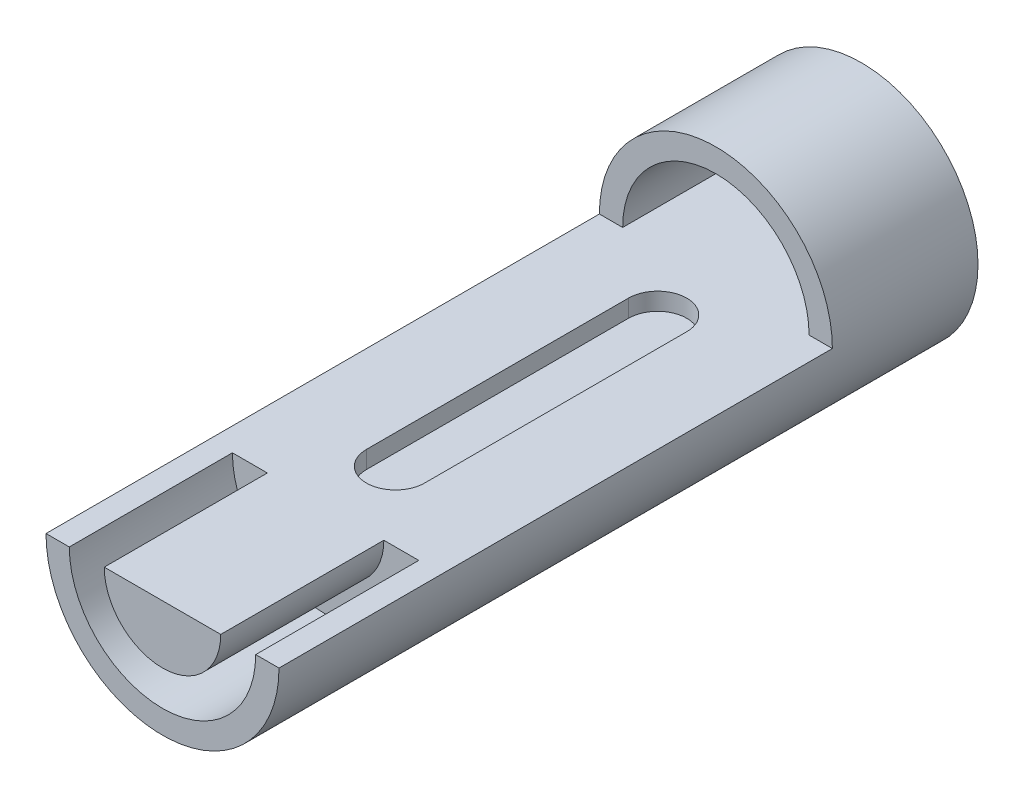
ISO-10303-21;
HEADER;
FILE_DESCRIPTION(('STEP AP214'),'2;1');
FILE_NAME('part.step','',(''),(''),'','','');
FILE_SCHEMA(('AUTOMOTIVE_DESIGN { 1 0 10303 214 1 1 1 1 }'));
ENDSEC;
DATA;
#1=APPLICATION_CONTEXT('core data for automotive mechanical design processes');
#2=APPLICATION_PROTOCOL_DEFINITION('international standard','automotive_design',2000,#1);
#3=PRODUCT_CONTEXT('',#1,'mechanical');
#4=PRODUCT('Part','Part','',(#3));
#5=PRODUCT_RELATED_PRODUCT_CATEGORY('part','',(#4));
#6=PRODUCT_DEFINITION_FORMATION('','',#4);
#7=PRODUCT_DEFINITION_CONTEXT('part definition',#1,'design');
#8=PRODUCT_DEFINITION('design','',#6,#7);
#9=PRODUCT_DEFINITION_SHAPE('','',#8);
#10=(LENGTH_UNIT() NAMED_UNIT(*) SI_UNIT(.MILLI.,.METRE.));
#11=(NAMED_UNIT(*) PLANE_ANGLE_UNIT() SI_UNIT($,.RADIAN.));
#12=(NAMED_UNIT(*) SI_UNIT($,.STERADIAN.) SOLID_ANGLE_UNIT());
#13=UNCERTAINTY_MEASURE_WITH_UNIT(LENGTH_MEASURE(1.E-05),#10,'distance_accuracy_value','');
#14=(GEOMETRIC_REPRESENTATION_CONTEXT(3) GLOBAL_UNCERTAINTY_ASSIGNED_CONTEXT((#13)) GLOBAL_UNIT_ASSIGNED_CONTEXT((#10,
#11,#12)) REPRESENTATION_CONTEXT('',''));
#15=CARTESIAN_POINT('',(0.,0.,0.));
#16=DIRECTION('',(0.,0.,1.));
#17=DIRECTION('',(1.,0.,0.));
#18=AXIS2_PLACEMENT_3D('',#15,#16,#17);
#19=CARTESIAN_POINT('',(0.,0.,120.));
#20=DIRECTION('',(0.,0.,1.));
#21=DIRECTION('',(1.,0.,0.));
#22=AXIS2_PLACEMENT_3D('',#19,#20,#21);
#23=PLANE('',#22);
#24=DIRECTION('',(1.,0.,0.));
#25=VECTOR('',#24,1.);
#26=CARTESIAN_POINT('',(-20.,0.,120.));
#27=LINE('',#26,#25);
#28=CARTESIAN_POINT('',(-10.,0.,120.));
#29=VERTEX_POINT('',#28);
#30=CARTESIAN_POINT('',(10.,0.,120.));
#31=VERTEX_POINT('',#30);
#32=EDGE_CURVE('E246',#29,#31,#27,.T.);
#33=ORIENTED_EDGE('',*,*,#32,.F.);
#34=CARTESIAN_POINT('',(0.,0.,120.));
#35=DIRECTION('',(0.,0.,1.));
#36=DIRECTION('',(1.,0.,0.));
#37=AXIS2_PLACEMENT_3D('',#34,#35,#36);
#38=CIRCLE('',#37,10.);
#39=EDGE_CURVE('E178',#29,#31,#38,.T.);
#40=ORIENTED_EDGE('',*,*,#39,.T.);
#41=EDGE_LOOP('',(#33,#40));
#42=FACE_BOUND('',#41,.T.);
#43=ADVANCED_FACE('F41',(#42),#23,.T.);
#44=CARTESIAN_POINT('',(-20.,0.,25.));
#45=DIRECTION('',(0.,-1.,0.));
#46=DIRECTION('',(0.,0.,-1.));
#47=AXIS2_PLACEMENT_3D('',#44,#45,#46);
#48=PLANE('',#47);
#49=CARTESIAN_POINT('',(0.,0.,80.));
#50=DIRECTION('',(0.,1.,0.));
#51=DIRECTION('',(0.,0.,1.));
#52=AXIS2_PLACEMENT_3D('',#49,#50,#51);
#53=CIRCLE('',#52,5.);
#54=CARTESIAN_POINT('',(-5.00000000000002,0.,80.));
#55=VERTEX_POINT('',#54);
#56=CARTESIAN_POINT('',(4.99999999999998,0.,80.));
#57=VERTEX_POINT('',#56);
#58=EDGE_CURVE('E170',#55,#57,#53,.T.);
#59=ORIENTED_EDGE('',*,*,#58,.F.);
#60=DIRECTION('',(0.,0.,1.));
#61=VECTOR('',#60,1.);
#62=CARTESIAN_POINT('',(-5.00000000000001,0.,0.));
#63=LINE('',#62,#61);
#64=CARTESIAN_POINT('',(-5.00000000000001,0.,35.));
#65=VERTEX_POINT('',#64);
#66=EDGE_CURVE('E57',#65,#55,#63,.T.);
#67=ORIENTED_EDGE('',*,*,#66,.F.);
#68=CARTESIAN_POINT('',(0.,0.,35.));
#69=DIRECTION('',(0.,1.,0.));
#70=DIRECTION('',(0.,0.,1.));
#71=AXIS2_PLACEMENT_3D('',#68,#69,#70);
#72=CIRCLE('',#71,5.);
#73=CARTESIAN_POINT('',(4.99999999999999,0.,35.));
#74=VERTEX_POINT('',#73);
#75=EDGE_CURVE('E155',#74,#65,#72,.T.);
#76=ORIENTED_EDGE('',*,*,#75,.F.);
#77=DIRECTION('',(0.,0.,1.));
#78=VECTOR('',#77,1.);
#79=CARTESIAN_POINT('',(4.99999999999999,0.,0.));
#80=LINE('',#79,#78);
#81=EDGE_CURVE('E161',#74,#57,#80,.T.);
#82=ORIENTED_EDGE('',*,*,#81,.T.);
#83=EDGE_LOOP('',(#59,#67,#76,#82));
#84=FACE_BOUND('',#83,.T.);
#85=DIRECTION('',(0.,0.,1.));
#86=VECTOR('',#85,1.);
#87=CARTESIAN_POINT('',(10.,0.,92.));
#88=LINE('',#87,#86);
#89=CARTESIAN_POINT('',(10.,0.,92.));
#90=VERTEX_POINT('',#89);
#91=EDGE_CURVE('E200',#90,#31,#88,.T.);
#92=ORIENTED_EDGE('',*,*,#91,.F.);
#93=DIRECTION('',(-1.,0.,0.));
#94=VECTOR('',#93,1.);
#95=CARTESIAN_POINT('',(0.,0.,92.));
#96=LINE('',#95,#94);
#97=CARTESIAN_POINT('',(16.,0.,92.));
#98=VERTEX_POINT('',#97);
#99=EDGE_CURVE('E191',#98,#90,#96,.T.);
#100=ORIENTED_EDGE('',*,*,#99,.F.);
#101=DIRECTION('',(0.,0.,1.));
#102=VECTOR('',#101,1.);
#103=CARTESIAN_POINT('',(16.,0.,92.));
#104=LINE('',#103,#102);
#105=CARTESIAN_POINT('',(16.,0.,120.));
#106=VERTEX_POINT('',#105);
#107=EDGE_CURVE('E204',#98,#106,#104,.T.);
#108=ORIENTED_EDGE('',*,*,#107,.T.);
#109=CARTESIAN_POINT('',(20.,0.,120.));
#110=VERTEX_POINT('',#109);
#111=EDGE_CURVE('E230',#106,#110,#27,.T.);
#112=ORIENTED_EDGE('',*,*,#111,.T.);
#113=DIRECTION('',(0.,0.,1.));
#114=VECTOR('',#113,1.);
#115=CARTESIAN_POINT('',(20.,0.,25.));
#116=LINE('',#115,#114);
#117=CARTESIAN_POINT('',(20.,0.,25.));
#118=VERTEX_POINT('',#117);
#119=EDGE_CURVE('E247',#118,#110,#116,.T.);
#120=ORIENTED_EDGE('',*,*,#119,.F.);
#121=DIRECTION('',(1.,0.,0.));
#122=VECTOR('',#121,1.);
#123=CARTESIAN_POINT('',(-20.,0.,25.));
#124=LINE('',#123,#122);
#125=CARTESIAN_POINT('',(16.,0.,25.));
#126=VERTEX_POINT('',#125);
#127=EDGE_CURVE('E236',#126,#118,#124,.T.);
#128=ORIENTED_EDGE('',*,*,#127,.F.);
#129=DIRECTION('',(0.,0.,1.));
#130=VECTOR('',#129,1.);
#131=CARTESIAN_POINT('',(16.,0.,0.));
#132=LINE('',#131,#130);
#133=CARTESIAN_POINT('',(16.,0.,0.));
#134=VERTEX_POINT('',#133);
#135=EDGE_CURVE('E223',#134,#126,#132,.T.);
#136=ORIENTED_EDGE('',*,*,#135,.F.);
#137=DIRECTION('',(1.,0.,0.));
#138=VECTOR('',#137,1.);
#139=CARTESIAN_POINT('',(0.,0.,0.));
#140=LINE('',#139,#138);
#141=CARTESIAN_POINT('',(-16.,0.,0.));
#142=VERTEX_POINT('',#141);
#143=EDGE_CURVE('E215',#142,#134,#140,.T.);
#144=ORIENTED_EDGE('',*,*,#143,.F.);
#145=DIRECTION('',(0.,0.,1.));
#146=VECTOR('',#145,1.);
#147=CARTESIAN_POINT('',(-16.,0.,0.));
#148=LINE('',#147,#146);
#149=CARTESIAN_POINT('',(-16.,0.,25.));
#150=VERTEX_POINT('',#149);
#151=EDGE_CURVE('E227',#142,#150,#148,.T.);
#152=ORIENTED_EDGE('',*,*,#151,.T.);
#153=CARTESIAN_POINT('',(-20.,0.,25.));
#154=VERTEX_POINT('',#153);
#155=EDGE_CURVE('E238',#154,#150,#124,.T.);
#156=ORIENTED_EDGE('',*,*,#155,.F.);
#157=DIRECTION('',(0.,0.,1.));
#158=VECTOR('',#157,1.);
#159=CARTESIAN_POINT('',(-20.,0.,25.));
#160=LINE('',#159,#158);
#161=CARTESIAN_POINT('',(-20.,0.,120.));
#162=VERTEX_POINT('',#161);
#163=EDGE_CURVE('E242',#154,#162,#160,.T.);
#164=ORIENTED_EDGE('',*,*,#163,.T.);
#165=CARTESIAN_POINT('',(-16.,0.,120.));
#166=VERTEX_POINT('',#165);
#167=EDGE_CURVE('E237',#162,#166,#27,.T.);
#168=ORIENTED_EDGE('',*,*,#167,.T.);
#169=DIRECTION('',(0.,0.,1.));
#170=VECTOR('',#169,1.);
#171=CARTESIAN_POINT('',(-16.,0.,92.));
#172=LINE('',#171,#170);
#173=CARTESIAN_POINT('',(-16.,0.,92.));
#174=VERTEX_POINT('',#173);
#175=EDGE_CURVE('E208',#174,#166,#172,.T.);
#176=ORIENTED_EDGE('',*,*,#175,.F.);
#177=CARTESIAN_POINT('',(-10.,0.,92.));
#178=VERTEX_POINT('',#177);
#179=EDGE_CURVE('E186',#178,#174,#96,.T.);
#180=ORIENTED_EDGE('',*,*,#179,.F.);
#181=DIRECTION('',(0.,0.,1.));
#182=VECTOR('',#181,1.);
#183=CARTESIAN_POINT('',(-10.,0.,92.));
#184=LINE('',#183,#182);
#185=EDGE_CURVE('E211',#178,#29,#184,.T.);
#186=ORIENTED_EDGE('',*,*,#185,.T.);
#187=ORIENTED_EDGE('',*,*,#32,.T.);
#188=EDGE_LOOP('',(#92,#100,#108,#112,#120,#128,#136,#144,#152,#156,#164,#168,#176,#180,#186,#187));
#189=FACE_BOUND('',#188,.T.);
#190=ADVANCED_FACE('F258',(#84,#189),#48,.F.);
#191=CARTESIAN_POINT('',(0.,0.,120.));
#192=DIRECTION('',(0.,0.,-1.));
#193=DIRECTION('',(-1.,0.,0.));
#194=AXIS2_PLACEMENT_3D('',#191,#192,#193);
#195=CYLINDRICAL_SURFACE('',#194,20.);
#196=CARTESIAN_POINT('',(0.,0.,120.));
#197=DIRECTION('',(0.,0.,1.));
#198=DIRECTION('',(1.,0.,0.));
#199=AXIS2_PLACEMENT_3D('',#196,#197,#198);
#200=CIRCLE('',#199,20.);
#201=EDGE_CURVE('E11',#162,#110,#200,.T.);
#202=ORIENTED_EDGE('',*,*,#201,.F.);
#203=ORIENTED_EDGE('',*,*,#163,.F.);
#204=CARTESIAN_POINT('',(0.,0.,25.));
#205=DIRECTION('',(0.,0.,1.));
#206=DIRECTION('',(1.,0.,0.));
#207=AXIS2_PLACEMENT_3D('',#204,#205,#206);
#208=CIRCLE('',#207,20.);
#209=EDGE_CURVE('E233',#118,#154,#208,.T.);
#210=ORIENTED_EDGE('',*,*,#209,.F.);
#211=ORIENTED_EDGE('',*,*,#119,.T.);
#212=EDGE_LOOP('',(#202,#203,#210,#211));
#213=FACE_BOUND('',#212,.T.);
#214=CARTESIAN_POINT('',(0.,0.,0.));
#215=DIRECTION('',(0.,0.,1.));
#216=DIRECTION('',(1.,0.,0.));
#217=AXIS2_PLACEMENT_3D('',#214,#215,#216);
#218=CIRCLE('',#217,20.);
#219=CARTESIAN_POINT('',(20.,0.,0.));
#220=VERTEX_POINT('',#219);
#221=EDGE_CURVE('E45',#220,#220,#218,.T.);
#222=ORIENTED_EDGE('',*,*,#221,.T.);
#223=EDGE_LOOP('',(#222));
#224=FACE_BOUND('',#223,.T.);
#225=ADVANCED_FACE('F43',(#213,#224),#195,.T.);
#226=CARTESIAN_POINT('',(0.,0.,120.));
#227=DIRECTION('',(0.,0.,1.));
#228=DIRECTION('',(1.,0.,0.));
#229=AXIS2_PLACEMENT_3D('',#226,#227,#228);
#230=CIRCLE('',#229,16.);
#231=EDGE_CURVE('E187',#166,#106,#230,.T.);
#232=ORIENTED_EDGE('',*,*,#231,.F.);
#233=ORIENTED_EDGE('',*,*,#167,.F.);
#234=ORIENTED_EDGE('',*,*,#201,.T.);
#235=ORIENTED_EDGE('',*,*,#111,.F.);
#236=EDGE_LOOP('',(#232,#233,#234,#235));
#237=FACE_BOUND('',#236,.T.);
#238=ADVANCED_FACE('F265',(#237),#23,.T.);
#239=CARTESIAN_POINT('',(0.,0.,0.));
#240=DIRECTION('',(0.,0.,1.));
#241=DIRECTION('',(1.,0.,0.));
#242=AXIS2_PLACEMENT_3D('',#239,#240,#241);
#243=PLANE('',#242);
#244=CARTESIAN_POINT('',(0.,0.,0.));
#245=DIRECTION('',(0.,0.,1.));
#246=DIRECTION('',(1.,0.,0.));
#247=AXIS2_PLACEMENT_3D('',#244,#245,#246);
#248=CIRCLE('',#247,16.);
#249=EDGE_CURVE('E219',#134,#142,#248,.T.);
#250=ORIENTED_EDGE('',*,*,#249,.T.);
#251=ORIENTED_EDGE('',*,*,#143,.T.);
#252=EDGE_LOOP('',(#250,#251));
#253=FACE_BOUND('',#252,.T.);
#254=ORIENTED_EDGE('',*,*,#221,.F.);
#255=EDGE_LOOP('',(#254));
#256=FACE_BOUND('',#255,.T.);
#257=ADVANCED_FACE('F317',(#253,#256),#243,.F.);
#258=CARTESIAN_POINT('',(0.,0.,25.));
#259=DIRECTION('',(0.,0.,1.));
#260=DIRECTION('',(1.,0.,0.));
#261=AXIS2_PLACEMENT_3D('',#258,#259,#260);
#262=PLANE('',#261);
#263=CARTESIAN_POINT('',(0.,0.,25.));
#264=DIRECTION('',(0.,0.,1.));
#265=DIRECTION('',(1.,0.,0.));
#266=AXIS2_PLACEMENT_3D('',#263,#264,#265);
#267=CIRCLE('',#266,16.);
#268=EDGE_CURVE('E203',#126,#150,#267,.T.);
#269=ORIENTED_EDGE('',*,*,#268,.F.);
#270=ORIENTED_EDGE('',*,*,#127,.T.);
#271=ORIENTED_EDGE('',*,*,#209,.T.);
#272=ORIENTED_EDGE('',*,*,#155,.T.);
#273=EDGE_LOOP('',(#269,#270,#271,#272));
#274=FACE_BOUND('',#273,.T.);
#275=ADVANCED_FACE('F322',(#274),#262,.T.);
#276=CARTESIAN_POINT('',(0.,0.,0.));
#277=DIRECTION('',(0.,0.,1.));
#278=DIRECTION('',(1.,0.,0.));
#279=AXIS2_PLACEMENT_3D('',#276,#277,#278);
#280=CYLINDRICAL_SURFACE('',#279,16.);
#281=ORIENTED_EDGE('',*,*,#268,.T.);
#282=ORIENTED_EDGE('',*,*,#151,.F.);
#283=ORIENTED_EDGE('',*,*,#249,.F.);
#284=ORIENTED_EDGE('',*,*,#135,.T.);
#285=EDGE_LOOP('',(#281,#282,#283,#284));
#286=FACE_BOUND('',#285,.T.);
#287=ADVANCED_FACE('F307',(#286),#280,.F.);
#288=CARTESIAN_POINT('',(0.,0.,92.));
#289=DIRECTION('',(0.,0.,1.));
#290=DIRECTION('',(1.,0.,0.));
#291=AXIS2_PLACEMENT_3D('',#288,#289,#290);
#292=CYLINDRICAL_SURFACE('',#291,10.);
#293=ORIENTED_EDGE('',*,*,#39,.F.);
#294=ORIENTED_EDGE('',*,*,#185,.F.);
#295=CARTESIAN_POINT('',(0.,0.,92.));
#296=DIRECTION('',(0.,0.,1.));
#297=DIRECTION('',(1.,0.,0.));
#298=AXIS2_PLACEMENT_3D('',#295,#296,#297);
#299=CIRCLE('',#298,10.);
#300=EDGE_CURVE('E65',#178,#90,#299,.T.);
#301=ORIENTED_EDGE('',*,*,#300,.T.);
#302=ORIENTED_EDGE('',*,*,#91,.T.);
#303=EDGE_LOOP('',(#293,#294,#301,#302));
#304=FACE_BOUND('',#303,.T.);
#305=ADVANCED_FACE('F280',(#304),#292,.T.);
#306=CARTESIAN_POINT('',(0.,0.,92.));
#307=DIRECTION('',(0.,0.,1.));
#308=DIRECTION('',(1.,0.,0.));
#309=AXIS2_PLACEMENT_3D('',#306,#307,#308);
#310=CYLINDRICAL_SURFACE('',#309,16.);
#311=ORIENTED_EDGE('',*,*,#231,.T.);
#312=ORIENTED_EDGE('',*,*,#107,.F.);
#313=CARTESIAN_POINT('',(0.,0.,92.));
#314=DIRECTION('',(0.,0.,1.));
#315=DIRECTION('',(1.,0.,0.));
#316=AXIS2_PLACEMENT_3D('',#313,#314,#315);
#317=CIRCLE('',#316,16.);
#318=EDGE_CURVE('E190',#174,#98,#317,.T.);
#319=ORIENTED_EDGE('',*,*,#318,.F.);
#320=ORIENTED_EDGE('',*,*,#175,.T.);
#321=EDGE_LOOP('',(#311,#312,#319,#320));
#322=FACE_BOUND('',#321,.T.);
#323=ADVANCED_FACE('F299',(#322),#310,.F.);
#324=CARTESIAN_POINT('',(0.,0.,92.));
#325=DIRECTION('',(0.,0.,1.));
#326=DIRECTION('',(1.,0.,0.));
#327=AXIS2_PLACEMENT_3D('',#324,#325,#326);
#328=PLANE('',#327);
#329=ORIENTED_EDGE('',*,*,#300,.F.);
#330=ORIENTED_EDGE('',*,*,#179,.T.);
#331=ORIENTED_EDGE('',*,*,#318,.T.);
#332=ORIENTED_EDGE('',*,*,#99,.T.);
#333=EDGE_LOOP('',(#329,#330,#331,#332));
#334=FACE_BOUND('',#333,.T.);
#335=ADVANCED_FACE('F281',(#334),#328,.T.);
#336=CARTESIAN_POINT('',(-5.00000000000001,-3.,0.));
#337=DIRECTION('',(-1.,0.,0.));
#338=DIRECTION('',(0.,0.,1.));
#339=AXIS2_PLACEMENT_3D('',#336,#337,#338);
#340=PLANE('',#339);
#341=ORIENTED_EDGE('',*,*,#66,.T.);
#342=DIRECTION('',(0.,1.,0.));
#343=VECTOR('',#342,1.);
#344=CARTESIAN_POINT('',(-5.00000000000002,-3.,80.));
#345=LINE('',#344,#343);
#346=CARTESIAN_POINT('',(-5.00000000000002,-3.,80.));
#347=VERTEX_POINT('',#346);
#348=EDGE_CURVE('E130',#347,#55,#345,.T.);
#349=ORIENTED_EDGE('',*,*,#348,.F.);
#350=DIRECTION('',(0.,0.,1.));
#351=VECTOR('',#350,1.);
#352=CARTESIAN_POINT('',(-5.00000000000001,-3.,0.));
#353=LINE('',#352,#351);
#354=CARTESIAN_POINT('',(-5.00000000000001,-3.,35.));
#355=VERTEX_POINT('',#354);
#356=EDGE_CURVE('E134',#355,#347,#353,.T.);
#357=ORIENTED_EDGE('',*,*,#356,.F.);
#358=DIRECTION('',(0.,1.,0.));
#359=VECTOR('',#358,1.);
#360=CARTESIAN_POINT('',(-5.00000000000001,-3.,35.));
#361=LINE('',#360,#359);
#362=EDGE_CURVE('E176',#355,#65,#361,.T.);
#363=ORIENTED_EDGE('',*,*,#362,.T.);
#364=EDGE_LOOP('',(#341,#349,#357,#363));
#365=FACE_BOUND('',#364,.T.);
#366=ADVANCED_FACE('F132',(#365),#340,.F.);
#367=CARTESIAN_POINT('',(0.,-3.,35.));
#368=DIRECTION('',(0.,1.,0.));
#369=DIRECTION('',(0.,0.,1.));
#370=AXIS2_PLACEMENT_3D('',#367,#368,#369);
#371=CYLINDRICAL_SURFACE('',#370,5.);
#372=ORIENTED_EDGE('',*,*,#75,.T.);
#373=ORIENTED_EDGE('',*,*,#362,.F.);
#374=CARTESIAN_POINT('',(0.,-3.,35.));
#375=DIRECTION('',(0.,1.,0.));
#376=DIRECTION('',(0.,0.,1.));
#377=AXIS2_PLACEMENT_3D('',#374,#375,#376);
#378=CIRCLE('',#377,5.);
#379=CARTESIAN_POINT('',(4.99999999999999,-3.,35.));
#380=VERTEX_POINT('',#379);
#381=EDGE_CURVE('E141',#380,#355,#378,.T.);
#382=ORIENTED_EDGE('',*,*,#381,.F.);
#383=DIRECTION('',(0.,1.,0.));
#384=VECTOR('',#383,1.);
#385=CARTESIAN_POINT('',(4.99999999999999,-3.,35.));
#386=LINE('',#385,#384);
#387=EDGE_CURVE('E179',#380,#74,#386,.T.);
#388=ORIENTED_EDGE('',*,*,#387,.T.);
#389=EDGE_LOOP('',(#372,#373,#382,#388));
#390=FACE_BOUND('',#389,.T.);
#391=ADVANCED_FACE('F364',(#390),#371,.F.);
#392=CARTESIAN_POINT('',(4.99999999999999,-3.,0.));
#393=DIRECTION('',(-1.,0.,0.));
#394=DIRECTION('',(0.,0.,1.));
#395=AXIS2_PLACEMENT_3D('',#392,#393,#394);
#396=PLANE('',#395);
#397=ORIENTED_EDGE('',*,*,#81,.F.);
#398=ORIENTED_EDGE('',*,*,#387,.F.);
#399=DIRECTION('',(0.,0.,1.));
#400=VECTOR('',#399,1.);
#401=CARTESIAN_POINT('',(4.99999999999999,-3.,0.));
#402=LINE('',#401,#400);
#403=CARTESIAN_POINT('',(4.99999999999998,-3.,80.));
#404=VERTEX_POINT('',#403);
#405=EDGE_CURVE('E150',#380,#404,#402,.T.);
#406=ORIENTED_EDGE('',*,*,#405,.T.);
#407=DIRECTION('',(0.,1.,0.));
#408=VECTOR('',#407,1.);
#409=CARTESIAN_POINT('',(4.99999999999998,-3.,80.));
#410=LINE('',#409,#408);
#411=EDGE_CURVE('E140',#404,#57,#410,.T.);
#412=ORIENTED_EDGE('',*,*,#411,.T.);
#413=EDGE_LOOP('',(#397,#398,#406,#412));
#414=FACE_BOUND('',#413,.T.);
#415=ADVANCED_FACE('F355',(#414),#396,.T.);
#416=CARTESIAN_POINT('',(0.,-3.,80.));
#417=DIRECTION('',(0.,1.,0.));
#418=DIRECTION('',(0.,0.,1.));
#419=AXIS2_PLACEMENT_3D('',#416,#417,#418);
#420=CYLINDRICAL_SURFACE('',#419,5.);
#421=ORIENTED_EDGE('',*,*,#58,.T.);
#422=ORIENTED_EDGE('',*,*,#411,.F.);
#423=CARTESIAN_POINT('',(0.,-3.,80.));
#424=DIRECTION('',(0.,1.,0.));
#425=DIRECTION('',(0.,0.,1.));
#426=AXIS2_PLACEMENT_3D('',#423,#424,#425);
#427=CIRCLE('',#426,5.);
#428=EDGE_CURVE('E145',#347,#404,#427,.T.);
#429=ORIENTED_EDGE('',*,*,#428,.F.);
#430=ORIENTED_EDGE('',*,*,#348,.T.);
#431=EDGE_LOOP('',(#421,#422,#429,#430));
#432=FACE_BOUND('',#431,.T.);
#433=ADVANCED_FACE('F146',(#432),#420,.F.);
#434=CARTESIAN_POINT('',(0.,-3.,0.));
#435=DIRECTION('',(0.,1.,0.));
#436=DIRECTION('',(0.,0.,1.));
#437=AXIS2_PLACEMENT_3D('',#434,#435,#436);
#438=PLANE('',#437);
#439=ORIENTED_EDGE('',*,*,#356,.T.);
#440=ORIENTED_EDGE('',*,*,#428,.T.);
#441=ORIENTED_EDGE('',*,*,#405,.F.);
#442=ORIENTED_EDGE('',*,*,#381,.T.);
#443=EDGE_LOOP('',(#439,#440,#441,#442));
#444=FACE_BOUND('',#443,.T.);
#445=ADVANCED_FACE('F152',(#444),#438,.T.);
#446=CLOSED_SHELL('',(#43,#190,#225,#238,#257,#275,#287,#305,#323,#335,#366,#391,#415,#433,#445));
#447=MANIFOLD_SOLID_BREP('B2',#446);
#448=ADVANCED_BREP_SHAPE_REPRESENTATION('',(#18,#447),#14);
#449=SHAPE_DEFINITION_REPRESENTATION(#9,#448);
ENDSEC;
END-ISO-10303-21;
